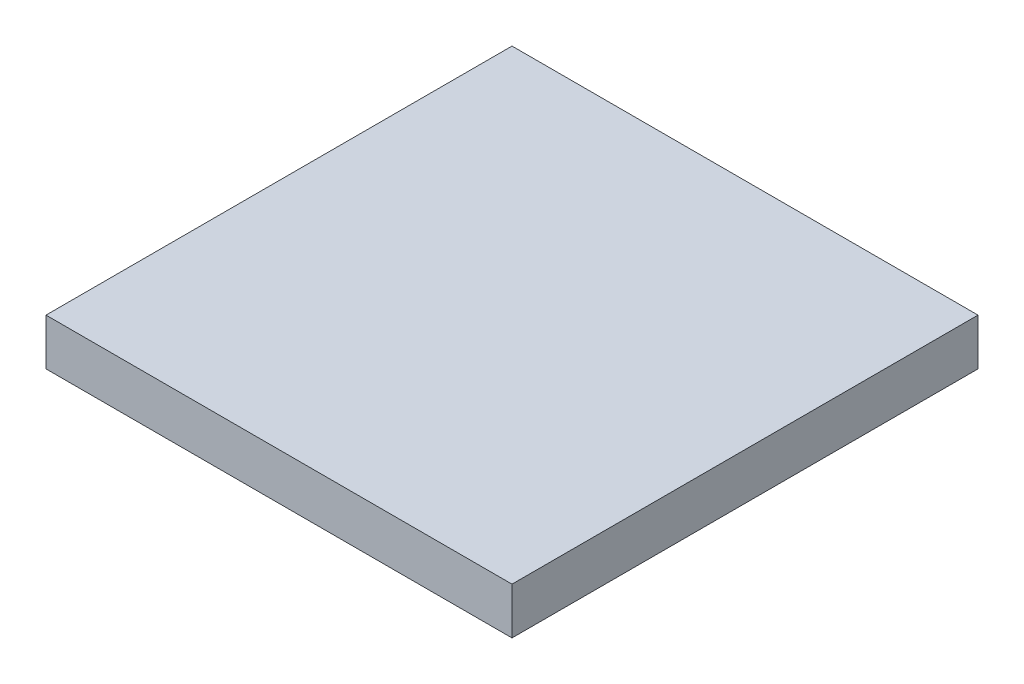
ISO-10303-21;
HEADER;
FILE_DESCRIPTION(('STEP AP214'),'2;1');
FILE_NAME('part.step','',(''),(''),'','','');
FILE_SCHEMA(('AUTOMOTIVE_DESIGN { 1 0 10303 214 1 1 1 1 }'));
ENDSEC;
DATA;
#1=APPLICATION_CONTEXT('core data for automotive mechanical design processes');
#2=APPLICATION_PROTOCOL_DEFINITION('international standard','automotive_design',2000,#1);
#3=PRODUCT_CONTEXT('',#1,'mechanical');
#4=PRODUCT('Part','Part','',(#3));
#5=PRODUCT_RELATED_PRODUCT_CATEGORY('part','',(#4));
#6=PRODUCT_DEFINITION_FORMATION('','',#4);
#7=PRODUCT_DEFINITION_CONTEXT('part definition',#1,'design');
#8=PRODUCT_DEFINITION('design','',#6,#7);
#9=PRODUCT_DEFINITION_SHAPE('','',#8);
#10=(LENGTH_UNIT() NAMED_UNIT(*) SI_UNIT(.MILLI.,.METRE.));
#11=(NAMED_UNIT(*) PLANE_ANGLE_UNIT() SI_UNIT($,.RADIAN.));
#12=(NAMED_UNIT(*) SI_UNIT($,.STERADIAN.) SOLID_ANGLE_UNIT());
#13=UNCERTAINTY_MEASURE_WITH_UNIT(LENGTH_MEASURE(1.E-05),#10,'distance_accuracy_value','');
#14=(GEOMETRIC_REPRESENTATION_CONTEXT(3) GLOBAL_UNCERTAINTY_ASSIGNED_CONTEXT((#13)) GLOBAL_UNIT_ASSIGNED_CONTEXT((#10,
#11,#12)) REPRESENTATION_CONTEXT('',''));
#15=CARTESIAN_POINT('',(0.,0.,0.));
#16=DIRECTION('',(0.,0.,1.));
#17=DIRECTION('',(1.,0.,0.));
#18=AXIS2_PLACEMENT_3D('',#15,#16,#17);
#19=CARTESIAN_POINT('',(500.,-50.,1000.));
#20=DIRECTION('',(-1.,0.,0.));
#21=DIRECTION('',(0.,0.,1.));
#22=AXIS2_PLACEMENT_3D('',#19,#20,#21);
#23=PLANE('',#22);
#24=DIRECTION('',(0.,1.,0.));
#25=VECTOR('',#24,1.);
#26=CARTESIAN_POINT('',(500.,-50.,0.));
#27=LINE('',#26,#25);
#28=CARTESIAN_POINT('',(500.,-50.,0.));
#29=VERTEX_POINT('',#28);
#30=CARTESIAN_POINT('',(500.,50.,0.));
#31=VERTEX_POINT('',#30);
#32=EDGE_CURVE('E107',#29,#31,#27,.T.);
#33=ORIENTED_EDGE('',*,*,#32,.T.);
#34=DIRECTION('',(0.,0.,-1.));
#35=VECTOR('',#34,1.);
#36=CARTESIAN_POINT('',(500.,50.,1000.));
#37=LINE('',#36,#35);
#38=CARTESIAN_POINT('',(500.,50.,1000.));
#39=VERTEX_POINT('',#38);
#40=EDGE_CURVE('E11',#39,#31,#37,.T.);
#41=ORIENTED_EDGE('',*,*,#40,.F.);
#42=DIRECTION('',(0.,1.,0.));
#43=VECTOR('',#42,1.);
#44=CARTESIAN_POINT('',(500.,-50.,1000.));
#45=LINE('',#44,#43);
#46=CARTESIAN_POINT('',(500.,-50.,1000.));
#47=VERTEX_POINT('',#46);
#48=EDGE_CURVE('E91',#47,#39,#45,.T.);
#49=ORIENTED_EDGE('',*,*,#48,.F.);
#50=DIRECTION('',(0.,0.,-1.));
#51=VECTOR('',#50,1.);
#52=CARTESIAN_POINT('',(500.,-50.,1000.));
#53=LINE('',#52,#51);
#54=EDGE_CURVE('E103',#47,#29,#53,.T.);
#55=ORIENTED_EDGE('',*,*,#54,.T.);
#56=EDGE_LOOP('',(#33,#41,#49,#55));
#57=FACE_BOUND('',#56,.T.);
#58=ADVANCED_FACE('F39',(#57),#23,.F.);
#59=CARTESIAN_POINT('',(-500.,50.,1000.));
#60=DIRECTION('',(0.,-1.,0.));
#61=DIRECTION('',(0.,0.,-1.));
#62=AXIS2_PLACEMENT_3D('',#59,#60,#61);
#63=PLANE('',#62);
#64=DIRECTION('',(-1.,0.,0.));
#65=VECTOR('',#64,1.);
#66=CARTESIAN_POINT('',(-500.,50.,0.));
#67=LINE('',#66,#65);
#68=CARTESIAN_POINT('',(-500.,50.,0.));
#69=VERTEX_POINT('',#68);
#70=EDGE_CURVE('E96',#31,#69,#67,.T.);
#71=ORIENTED_EDGE('',*,*,#70,.T.);
#72=DIRECTION('',(0.,0.,-1.));
#73=VECTOR('',#72,1.);
#74=CARTESIAN_POINT('',(-500.,50.,1000.));
#75=LINE('',#74,#73);
#76=CARTESIAN_POINT('',(-500.,50.,1000.));
#77=VERTEX_POINT('',#76);
#78=EDGE_CURVE('E48',#77,#69,#75,.T.);
#79=ORIENTED_EDGE('',*,*,#78,.F.);
#80=DIRECTION('',(-1.,0.,0.));
#81=VECTOR('',#80,1.);
#82=CARTESIAN_POINT('',(-500.,50.,1000.));
#83=LINE('',#82,#81);
#84=EDGE_CURVE('E86',#39,#77,#83,.T.);
#85=ORIENTED_EDGE('',*,*,#84,.F.);
#86=ORIENTED_EDGE('',*,*,#40,.T.);
#87=EDGE_LOOP('',(#71,#79,#85,#86));
#88=FACE_BOUND('',#87,.T.);
#89=ADVANCED_FACE('F95',(#88),#63,.F.);
#90=CARTESIAN_POINT('',(-500.,-50.,1000.));
#91=DIRECTION('',(1.,0.,0.));
#92=DIRECTION('',(0.,0.,-1.));
#93=AXIS2_PLACEMENT_3D('',#90,#91,#92);
#94=PLANE('',#93);
#95=DIRECTION('',(0.,-1.,0.));
#96=VECTOR('',#95,1.);
#97=CARTESIAN_POINT('',(-500.,-50.,0.));
#98=LINE('',#97,#96);
#99=CARTESIAN_POINT('',(-500.,-50.,0.));
#100=VERTEX_POINT('',#99);
#101=EDGE_CURVE('E73',#69,#100,#98,.T.);
#102=ORIENTED_EDGE('',*,*,#101,.T.);
#103=DIRECTION('',(0.,0.,-1.));
#104=VECTOR('',#103,1.);
#105=CARTESIAN_POINT('',(-500.,-50.,1000.));
#106=LINE('',#105,#104);
#107=CARTESIAN_POINT('',(-500.,-50.,1000.));
#108=VERTEX_POINT('',#107);
#109=EDGE_CURVE('E98',#108,#100,#106,.T.);
#110=ORIENTED_EDGE('',*,*,#109,.F.);
#111=DIRECTION('',(0.,-1.,0.));
#112=VECTOR('',#111,1.);
#113=CARTESIAN_POINT('',(-500.,-50.,1000.));
#114=LINE('',#113,#112);
#115=EDGE_CURVE('E89',#77,#108,#114,.T.);
#116=ORIENTED_EDGE('',*,*,#115,.F.);
#117=ORIENTED_EDGE('',*,*,#78,.T.);
#118=EDGE_LOOP('',(#102,#110,#116,#117));
#119=FACE_BOUND('',#118,.T.);
#120=ADVANCED_FACE('F99',(#119),#94,.F.);
#121=CARTESIAN_POINT('',(-500.,-50.,1000.));
#122=DIRECTION('',(0.,1.,0.));
#123=DIRECTION('',(0.,0.,1.));
#124=AXIS2_PLACEMENT_3D('',#121,#122,#123);
#125=PLANE('',#124);
#126=DIRECTION('',(1.,0.,0.));
#127=VECTOR('',#126,1.);
#128=CARTESIAN_POINT('',(-500.,-50.,0.));
#129=LINE('',#128,#127);
#130=EDGE_CURVE('E79',#100,#29,#129,.T.);
#131=ORIENTED_EDGE('',*,*,#130,.T.);
#132=ORIENTED_EDGE('',*,*,#54,.F.);
#133=DIRECTION('',(1.,0.,0.));
#134=VECTOR('',#133,1.);
#135=CARTESIAN_POINT('',(-500.,-50.,1000.));
#136=LINE('',#135,#134);
#137=EDGE_CURVE('E56',#108,#47,#136,.T.);
#138=ORIENTED_EDGE('',*,*,#137,.F.);
#139=ORIENTED_EDGE('',*,*,#109,.T.);
#140=EDGE_LOOP('',(#131,#132,#138,#139));
#141=FACE_BOUND('',#140,.T.);
#142=ADVANCED_FACE('F120',(#141),#125,.F.);
#143=CARTESIAN_POINT('',(0.,0.,1000.));
#144=DIRECTION('',(0.,0.,-1.));
#145=DIRECTION('',(-1.,0.,0.));
#146=AXIS2_PLACEMENT_3D('',#143,#144,#145);
#147=PLANE('',#146);
#148=ORIENTED_EDGE('',*,*,#48,.T.);
#149=ORIENTED_EDGE('',*,*,#84,.T.);
#150=ORIENTED_EDGE('',*,*,#115,.T.);
#151=ORIENTED_EDGE('',*,*,#137,.T.);
#152=EDGE_LOOP('',(#148,#149,#150,#151));
#153=FACE_BOUND('',#152,.T.);
#154=ADVANCED_FACE('F87',(#153),#147,.F.);
#155=CARTESIAN_POINT('',(0.,0.,0.));
#156=DIRECTION('',(0.,0.,-1.));
#157=DIRECTION('',(-1.,0.,0.));
#158=AXIS2_PLACEMENT_3D('',#155,#156,#157);
#159=PLANE('',#158);
#160=ORIENTED_EDGE('',*,*,#32,.F.);
#161=ORIENTED_EDGE('',*,*,#130,.F.);
#162=ORIENTED_EDGE('',*,*,#101,.F.);
#163=ORIENTED_EDGE('',*,*,#70,.F.);
#164=EDGE_LOOP('',(#160,#161,#162,#163));
#165=FACE_BOUND('',#164,.T.);
#166=ADVANCED_FACE('F123',(#165),#159,.T.);
#167=CLOSED_SHELL('',(#58,#89,#120,#142,#154,#166));
#168=MANIFOLD_SOLID_BREP('B2',#167);
#169=ADVANCED_BREP_SHAPE_REPRESENTATION('',(#18,#168),#14);
#170=SHAPE_DEFINITION_REPRESENTATION(#9,#169);
ENDSEC;
END-ISO-10303-21;
